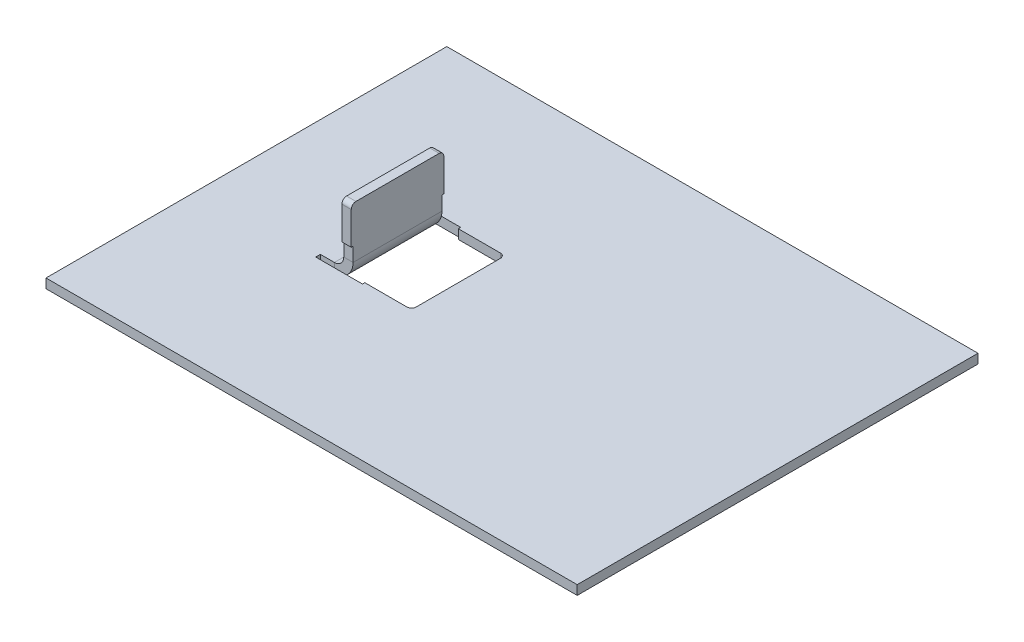
ISO-10303-21;
HEADER;
FILE_DESCRIPTION(('STEP AP214'),'2;1');
FILE_NAME('part.step','',(''),(''),'','','');
FILE_SCHEMA(('AUTOMOTIVE_DESIGN { 1 0 10303 214 1 1 1 1 }'));
ENDSEC;
DATA;
#1=APPLICATION_CONTEXT('core data for automotive mechanical design processes');
#2=APPLICATION_PROTOCOL_DEFINITION('international standard','automotive_design',2000,#1);
#3=PRODUCT_CONTEXT('',#1,'mechanical');
#4=PRODUCT('Part','Part','',(#3));
#5=PRODUCT_RELATED_PRODUCT_CATEGORY('part','',(#4));
#6=PRODUCT_DEFINITION_FORMATION('','',#4);
#7=PRODUCT_DEFINITION_CONTEXT('part definition',#1,'design');
#8=PRODUCT_DEFINITION('design','',#6,#7);
#9=PRODUCT_DEFINITION_SHAPE('','',#8);
#10=(LENGTH_UNIT() NAMED_UNIT(*) SI_UNIT(.MILLI.,.METRE.));
#11=(NAMED_UNIT(*) PLANE_ANGLE_UNIT() SI_UNIT($,.RADIAN.));
#12=(NAMED_UNIT(*) SI_UNIT($,.STERADIAN.) SOLID_ANGLE_UNIT());
#13=UNCERTAINTY_MEASURE_WITH_UNIT(LENGTH_MEASURE(1.E-05),#10,'distance_accuracy_value','');
#14=(GEOMETRIC_REPRESENTATION_CONTEXT(3) GLOBAL_UNCERTAINTY_ASSIGNED_CONTEXT((#13)) GLOBAL_UNIT_ASSIGNED_CONTEXT((#10,
#11,#12)) REPRESENTATION_CONTEXT('',''));
#15=CARTESIAN_POINT('',(0.,0.,0.));
#16=DIRECTION('',(0.,0.,1.));
#17=DIRECTION('',(1.,0.,0.));
#18=AXIS2_PLACEMENT_3D('',#15,#16,#17);
#19=CARTESIAN_POINT('',(29.9664364091211,33.,-33.7227848020921));
#20=DIRECTION('',(0.,0.,-1.));
#21=DIRECTION('',(0.,1.,0.));
#22=AXIS2_PLACEMENT_3D('',#19,#20,#21);
#23=PLANE('',#22);
#24=DIRECTION('',(-1.,0.,0.));
#25=VECTOR('',#24,1.);
#26=CARTESIAN_POINT('',(29.9664364091211,22.,-33.7227848020921));
#27=LINE('',#26,#25);
#28=CARTESIAN_POINT('',(31.9664364091211,22.,-33.7227848020921));
#29=VERTEX_POINT('',#28);
#30=CARTESIAN_POINT('',(29.9664364091211,22.,-33.7227848020921));
#31=VERTEX_POINT('',#30);
#32=EDGE_CURVE('E11',#29,#31,#27,.T.);
#33=ORIENTED_EDGE('',*,*,#32,.F.);
#34=DIRECTION('',(0.,1.,0.));
#35=VECTOR('',#34,1.);
#36=CARTESIAN_POINT('',(31.9664364091211,33.,-33.7227848020921));
#37=LINE('',#36,#35);
#38=CARTESIAN_POINT('',(31.9664364091211,25.,-33.7227848020921));
#39=VERTEX_POINT('',#38);
#40=EDGE_CURVE('E150',#29,#39,#37,.T.);
#41=ORIENTED_EDGE('',*,*,#40,.T.);
#42=DIRECTION('',(-1.,0.,0.));
#43=VECTOR('',#42,1.);
#44=CARTESIAN_POINT('',(29.9664364091211,25.,-33.7227848020921));
#45=LINE('',#44,#43);
#46=CARTESIAN_POINT('',(29.9664364091211,25.,-33.7227848020921));
#47=VERTEX_POINT('',#46);
#48=EDGE_CURVE('E50',#39,#47,#45,.T.);
#49=ORIENTED_EDGE('',*,*,#48,.T.);
#50=DIRECTION('',(0.,1.,0.));
#51=VECTOR('',#50,1.);
#52=CARTESIAN_POINT('',(29.9664364091211,33.,-33.7227848020921));
#53=LINE('',#52,#51);
#54=EDGE_CURVE('E153',#31,#47,#53,.T.);
#55=ORIENTED_EDGE('',*,*,#54,.F.);
#56=EDGE_LOOP('',(#33,#41,#49,#55));
#57=FACE_BOUND('',#56,.T.);
#58=ADVANCED_FACE('F40',(#57),#23,.F.);
#59=CARTESIAN_POINT('',(29.9664364091211,25.,-53.2227848020921));
#60=DIRECTION('',(0.,1.,0.));
#61=DIRECTION('',(0.,0.,1.));
#62=AXIS2_PLACEMENT_3D('',#59,#60,#61);
#63=PLANE('',#62);
#64=ORIENTED_EDGE('',*,*,#48,.F.);
#65=DIRECTION('',(0.,0.,-1.));
#66=VECTOR('',#65,1.);
#67=CARTESIAN_POINT('',(31.9664364091211,25.,-53.2227848020921));
#68=LINE('',#67,#66);
#69=CARTESIAN_POINT('',(31.9664364091211,25.,-33.3227848020921));
#70=VERTEX_POINT('',#69);
#71=EDGE_CURVE('E179',#39,#70,#68,.F.);
#72=ORIENTED_EDGE('',*,*,#71,.T.);
#73=DIRECTION('',(-1.,0.,0.));
#74=VECTOR('',#73,1.);
#75=CARTESIAN_POINT('',(29.9664364091211,25.,-33.3227848020921));
#76=LINE('',#75,#74);
#77=CARTESIAN_POINT('',(29.9664364091211,25.,-33.3227848020921));
#78=VERTEX_POINT('',#77);
#79=EDGE_CURVE('E260',#70,#78,#76,.T.);
#80=ORIENTED_EDGE('',*,*,#79,.T.);
#81=DIRECTION('',(0.,0.,1.));
#82=VECTOR('',#81,1.);
#83=CARTESIAN_POINT('',(29.9664364091211,25.,-53.2227848020921));
#84=LINE('',#83,#82);
#85=EDGE_CURVE('E274',#47,#78,#84,.T.);
#86=ORIENTED_EDGE('',*,*,#85,.F.);
#87=EDGE_LOOP('',(#64,#72,#80,#86));
#88=FACE_BOUND('',#87,.T.);
#89=ADVANCED_FACE('F280',(#88),#63,.F.);
#90=CARTESIAN_POINT('',(29.9664364091211,33.,-33.3227848020921));
#91=DIRECTION('',(0.,0.,1.));
#92=DIRECTION('',(0.,-1.,0.));
#93=AXIS2_PLACEMENT_3D('',#90,#91,#92);
#94=PLANE('',#93);
#95=ORIENTED_EDGE('',*,*,#79,.F.);
#96=DIRECTION('',(0.,1.,0.));
#97=VECTOR('',#96,1.);
#98=CARTESIAN_POINT('',(31.9664364091211,33.,-33.3227848020921));
#99=LINE('',#98,#97);
#100=CARTESIAN_POINT('',(31.9664364091211,32.,-33.3227848020921));
#101=VERTEX_POINT('',#100);
#102=EDGE_CURVE('E362',#101,#70,#99,.F.);
#103=ORIENTED_EDGE('',*,*,#102,.F.);
#104=DIRECTION('',(-1.,0.,0.));
#105=VECTOR('',#104,1.);
#106=CARTESIAN_POINT('',(29.9664364091211,32.,-33.3227848020921));
#107=LINE('',#106,#105);
#108=CARTESIAN_POINT('',(29.9664364091211,32.,-33.3227848020921));
#109=VERTEX_POINT('',#108);
#110=EDGE_CURVE('E257',#101,#109,#107,.T.);
#111=ORIENTED_EDGE('',*,*,#110,.T.);
#112=DIRECTION('',(0.,-1.,0.));
#113=VECTOR('',#112,1.);
#114=CARTESIAN_POINT('',(29.9664364091211,33.,-33.3227848020921));
#115=LINE('',#114,#113);
#116=EDGE_CURVE('E375',#109,#78,#115,.T.);
#117=ORIENTED_EDGE('',*,*,#116,.T.);
#118=EDGE_LOOP('',(#95,#103,#111,#117));
#119=FACE_BOUND('',#118,.T.);
#120=ADVANCED_FACE('F373',(#119),#94,.T.);
#121=CARTESIAN_POINT('',(29.9664364091211,32.,-34.3227848020921));
#122=DIRECTION('',(1.,0.,0.));
#123=DIRECTION('',(0.,0.,-1.));
#124=AXIS2_PLACEMENT_3D('',#121,#122,#123);
#125=CYLINDRICAL_SURFACE('',#124,1.);
#126=ORIENTED_EDGE('',*,*,#110,.F.);
#127=CARTESIAN_POINT('',(31.9664364091211,32.,-34.3227848020921));
#128=DIRECTION('',(1.,0.,0.));
#129=DIRECTION('',(0.,0.,-1.));
#130=AXIS2_PLACEMENT_3D('',#127,#128,#129);
#131=CIRCLE('',#130,1.);
#132=CARTESIAN_POINT('',(31.9664364091211,33.,-34.3227848020921));
#133=VERTEX_POINT('',#132);
#134=EDGE_CURVE('E309',#101,#133,#131,.F.);
#135=ORIENTED_EDGE('',*,*,#134,.T.);
#136=DIRECTION('',(-1.,0.,0.));
#137=VECTOR('',#136,1.);
#138=CARTESIAN_POINT('',(29.9664364091211,33.,-34.3227848020921));
#139=LINE('',#138,#137);
#140=CARTESIAN_POINT('',(29.9664364091211,33.,-34.3227848020921));
#141=VERTEX_POINT('',#140);
#142=EDGE_CURVE('E254',#133,#141,#139,.T.);
#143=ORIENTED_EDGE('',*,*,#142,.T.);
#144=CARTESIAN_POINT('',(29.9664364091211,32.,-34.3227848020921));
#145=DIRECTION('',(1.,0.,0.));
#146=DIRECTION('',(0.,0.,-1.));
#147=AXIS2_PLACEMENT_3D('',#144,#145,#146);
#148=CIRCLE('',#147,1.);
#149=EDGE_CURVE('E380',#109,#141,#148,.F.);
#150=ORIENTED_EDGE('',*,*,#149,.F.);
#151=EDGE_LOOP('',(#126,#135,#143,#150));
#152=FACE_BOUND('',#151,.T.);
#153=ADVANCED_FACE('F569',(#152),#125,.T.);
#154=CARTESIAN_POINT('',(29.9664364091211,33.,-53.2227848020921));
#155=DIRECTION('',(0.,1.,0.));
#156=DIRECTION('',(0.,0.,1.));
#157=AXIS2_PLACEMENT_3D('',#154,#155,#156);
#158=PLANE('',#157);
#159=ORIENTED_EDGE('',*,*,#142,.F.);
#160=DIRECTION('',(0.,0.,-1.));
#161=VECTOR('',#160,1.);
#162=CARTESIAN_POINT('',(31.9664364091211,33.,-53.2227848020921));
#163=LINE('',#162,#161);
#164=CARTESIAN_POINT('',(31.9664364091211,33.,-52.1227848020921));
#165=VERTEX_POINT('',#164);
#166=EDGE_CURVE('E185',#165,#133,#163,.F.);
#167=ORIENTED_EDGE('',*,*,#166,.F.);
#168=DIRECTION('',(-1.,0.,0.));
#169=VECTOR('',#168,1.);
#170=CARTESIAN_POINT('',(29.9664364091211,33.,-52.1227848020921));
#171=LINE('',#170,#169);
#172=CARTESIAN_POINT('',(29.9664364091211,33.,-52.1227848020921));
#173=VERTEX_POINT('',#172);
#174=EDGE_CURVE('E251',#165,#173,#171,.T.);
#175=ORIENTED_EDGE('',*,*,#174,.T.);
#176=DIRECTION('',(0.,0.,1.));
#177=VECTOR('',#176,1.);
#178=CARTESIAN_POINT('',(29.9664364091211,33.,-53.2227848020921));
#179=LINE('',#178,#177);
#180=EDGE_CURVE('E303',#173,#141,#179,.T.);
#181=ORIENTED_EDGE('',*,*,#180,.T.);
#182=EDGE_LOOP('',(#159,#167,#175,#181));
#183=FACE_BOUND('',#182,.T.);
#184=ADVANCED_FACE('F536',(#183),#158,.T.);
#185=CARTESIAN_POINT('',(29.9664364091211,32.,-52.1227848020921));
#186=DIRECTION('',(1.,0.,0.));
#187=DIRECTION('',(0.,0.,-1.));
#188=AXIS2_PLACEMENT_3D('',#185,#186,#187);
#189=CYLINDRICAL_SURFACE('',#188,1.);
#190=ORIENTED_EDGE('',*,*,#174,.F.);
#191=CARTESIAN_POINT('',(31.9664364091211,32.,-52.1227848020921));
#192=DIRECTION('',(1.,0.,0.));
#193=DIRECTION('',(0.,0.,-1.));
#194=AXIS2_PLACEMENT_3D('',#191,#192,#193);
#195=CIRCLE('',#194,1.);
#196=CARTESIAN_POINT('',(31.9664364091211,32.,-53.1227848020921));
#197=VERTEX_POINT('',#196);
#198=EDGE_CURVE('E363',#165,#197,#195,.F.);
#199=ORIENTED_EDGE('',*,*,#198,.T.);
#200=DIRECTION('',(-1.,0.,0.));
#201=VECTOR('',#200,1.);
#202=CARTESIAN_POINT('',(29.9664364091211,32.,-53.1227848020921));
#203=LINE('',#202,#201);
#204=CARTESIAN_POINT('',(29.9664364091211,32.,-53.1227848020921));
#205=VERTEX_POINT('',#204);
#206=EDGE_CURVE('E248',#197,#205,#203,.T.);
#207=ORIENTED_EDGE('',*,*,#206,.T.);
#208=CARTESIAN_POINT('',(29.9664364091211,32.,-52.1227848020921));
#209=DIRECTION('',(1.,0.,0.));
#210=DIRECTION('',(0.,0.,-1.));
#211=AXIS2_PLACEMENT_3D('',#208,#209,#210);
#212=CIRCLE('',#211,1.);
#213=EDGE_CURVE('E386',#173,#205,#212,.F.);
#214=ORIENTED_EDGE('',*,*,#213,.F.);
#215=EDGE_LOOP('',(#190,#199,#207,#214));
#216=FACE_BOUND('',#215,.T.);
#217=ADVANCED_FACE('F543',(#216),#189,.T.);
#218=CARTESIAN_POINT('',(29.9664364091211,33.,-53.1227848020921));
#219=DIRECTION('',(0.,0.,1.));
#220=DIRECTION('',(0.,-1.,0.));
#221=AXIS2_PLACEMENT_3D('',#218,#219,#220);
#222=PLANE('',#221);
#223=ORIENTED_EDGE('',*,*,#206,.F.);
#224=DIRECTION('',(0.,1.,0.));
#225=VECTOR('',#224,1.);
#226=CARTESIAN_POINT('',(31.9664364091211,33.,-53.1227848020921));
#227=LINE('',#226,#225);
#228=CARTESIAN_POINT('',(31.9664364091211,25.,-53.1227848020921));
#229=VERTEX_POINT('',#228);
#230=EDGE_CURVE('E359',#197,#229,#227,.F.);
#231=ORIENTED_EDGE('',*,*,#230,.T.);
#232=DIRECTION('',(-1.,0.,0.));
#233=VECTOR('',#232,1.);
#234=CARTESIAN_POINT('',(29.9664364091211,25.,-53.1227848020921));
#235=LINE('',#234,#233);
#236=CARTESIAN_POINT('',(29.9664364091211,25.,-53.1227848020921));
#237=VERTEX_POINT('',#236);
#238=EDGE_CURVE('E245',#229,#237,#235,.T.);
#239=ORIENTED_EDGE('',*,*,#238,.T.);
#240=DIRECTION('',(0.,-1.,0.));
#241=VECTOR('',#240,1.);
#242=CARTESIAN_POINT('',(29.9664364091211,33.,-53.1227848020921));
#243=LINE('',#242,#241);
#244=EDGE_CURVE('E381',#205,#237,#243,.T.);
#245=ORIENTED_EDGE('',*,*,#244,.F.);
#246=EDGE_LOOP('',(#223,#231,#239,#245));
#247=FACE_BOUND('',#246,.T.);
#248=ADVANCED_FACE('F546',(#247),#222,.F.);
#249=CARTESIAN_POINT('',(29.9664364091211,25.,-53.2227848020921));
#250=DIRECTION('',(0.,1.,0.));
#251=DIRECTION('',(0.,0.,1.));
#252=AXIS2_PLACEMENT_3D('',#249,#250,#251);
#253=PLANE('',#252);
#254=ORIENTED_EDGE('',*,*,#238,.F.);
#255=DIRECTION('',(0.,0.,-1.));
#256=VECTOR('',#255,1.);
#257=CARTESIAN_POINT('',(31.9664364091211,25.,-53.2227848020921));
#258=LINE('',#257,#256);
#259=CARTESIAN_POINT('',(31.9664364091211,25.,-52.7227848020921));
#260=VERTEX_POINT('',#259);
#261=EDGE_CURVE('E332',#229,#260,#258,.F.);
#262=ORIENTED_EDGE('',*,*,#261,.T.);
#263=DIRECTION('',(-1.,0.,0.));
#264=VECTOR('',#263,1.);
#265=CARTESIAN_POINT('',(29.9664364091211,25.,-52.7227848020921));
#266=LINE('',#265,#264);
#267=CARTESIAN_POINT('',(29.9664364091211,25.,-52.7227848020921));
#268=VERTEX_POINT('',#267);
#269=EDGE_CURVE('E242',#260,#268,#266,.T.);
#270=ORIENTED_EDGE('',*,*,#269,.T.);
#271=DIRECTION('',(0.,0.,1.));
#272=VECTOR('',#271,1.);
#273=CARTESIAN_POINT('',(29.9664364091211,25.,-53.2227848020921));
#274=LINE('',#273,#272);
#275=EDGE_CURVE('E416',#237,#268,#274,.T.);
#276=ORIENTED_EDGE('',*,*,#275,.F.);
#277=EDGE_LOOP('',(#254,#262,#270,#276));
#278=FACE_BOUND('',#277,.T.);
#279=ADVANCED_FACE('F549',(#278),#253,.F.);
#280=CARTESIAN_POINT('',(29.9664364091211,33.,-52.7227848020921));
#281=DIRECTION('',(0.,0.,1.));
#282=DIRECTION('',(0.,-1.,0.));
#283=AXIS2_PLACEMENT_3D('',#280,#281,#282);
#284=PLANE('',#283);
#285=ORIENTED_EDGE('',*,*,#269,.F.);
#286=DIRECTION('',(0.,1.,0.));
#287=VECTOR('',#286,1.);
#288=CARTESIAN_POINT('',(31.9664364091211,33.,-52.7227848020921));
#289=LINE('',#288,#287);
#290=CARTESIAN_POINT('',(31.9664364091211,22.,-52.7227848020921));
#291=VERTEX_POINT('',#290);
#292=EDGE_CURVE('E348',#260,#291,#289,.F.);
#293=ORIENTED_EDGE('',*,*,#292,.T.);
#294=DIRECTION('',(-1.,0.,0.));
#295=VECTOR('',#294,1.);
#296=CARTESIAN_POINT('',(29.9664364091211,22.,-52.7227848020921));
#297=LINE('',#296,#295);
#298=CARTESIAN_POINT('',(29.9664364091211,22.,-52.7227848020921));
#299=VERTEX_POINT('',#298);
#300=EDGE_CURVE('E239',#291,#299,#297,.T.);
#301=ORIENTED_EDGE('',*,*,#300,.T.);
#302=DIRECTION('',(0.,-1.,0.));
#303=VECTOR('',#302,1.);
#304=CARTESIAN_POINT('',(29.9664364091211,33.,-52.7227848020921));
#305=LINE('',#304,#303);
#306=EDGE_CURVE('E419',#268,#299,#305,.T.);
#307=ORIENTED_EDGE('',*,*,#306,.F.);
#308=EDGE_LOOP('',(#285,#293,#301,#307));
#309=FACE_BOUND('',#308,.T.);
#310=ADVANCED_FACE('F551',(#309),#284,.F.);
#311=CARTESIAN_POINT('',(27.9664364091211,22.,-52.7227848020921));
#312=DIRECTION('',(0.,0.,-1.));
#313=DIRECTION('',(-1.,0.,0.));
#314=AXIS2_PLACEMENT_3D('',#311,#312,#313);
#315=PLANE('',#314);
#316=ORIENTED_EDGE('',*,*,#300,.F.);
#317=CARTESIAN_POINT('',(27.9664364091211,22.,-52.7227848020921));
#318=DIRECTION('',(0.,0.,-1.));
#319=DIRECTION('',(-1.,0.,0.));
#320=AXIS2_PLACEMENT_3D('',#317,#318,#319);
#321=CIRCLE('',#320,4.);
#322=CARTESIAN_POINT('',(27.9664364091211,18.,-52.7227848020921));
#323=VERTEX_POINT('',#322);
#324=EDGE_CURVE('E168',#291,#323,#321,.T.);
#325=ORIENTED_EDGE('',*,*,#324,.T.);
#326=DIRECTION('',(0.,1.,0.));
#327=VECTOR('',#326,1.);
#328=CARTESIAN_POINT('',(27.9664364091211,20.,-52.7227848020921));
#329=LINE('',#328,#327);
#330=CARTESIAN_POINT('',(27.9664364091211,20.,-52.7227848020921));
#331=VERTEX_POINT('',#330);
#332=EDGE_CURVE('E58',#323,#331,#329,.T.);
#333=ORIENTED_EDGE('',*,*,#332,.T.);
#334=CARTESIAN_POINT('',(27.9664364091211,22.,-52.7227848020921));
#335=DIRECTION('',(0.,0.,1.));
#336=DIRECTION('',(1.,0.,0.));
#337=AXIS2_PLACEMENT_3D('',#334,#335,#336);
#338=CIRCLE('',#337,2.);
#339=EDGE_CURVE('E301',#299,#331,#338,.F.);
#340=ORIENTED_EDGE('',*,*,#339,.F.);
#341=EDGE_LOOP('',(#316,#325,#333,#340));
#342=FACE_BOUND('',#341,.T.);
#343=ADVANCED_FACE('F513',(#342),#315,.T.);
#344=CARTESIAN_POINT('',(0.,20.,-52.7227848020921));
#345=DIRECTION('',(0.,0.,1.));
#346=DIRECTION('',(-1.,0.,0.));
#347=AXIS2_PLACEMENT_3D('',#344,#345,#346);
#348=PLANE('',#347);
#349=ORIENTED_EDGE('',*,*,#332,.F.);
#350=DIRECTION('',(1.,0.,0.));
#351=VECTOR('',#350,1.);
#352=CARTESIAN_POINT('',(0.,18.,-52.7227848020921));
#353=LINE('',#352,#351);
#354=CARTESIAN_POINT('',(24.9664364091211,18.,-52.7227848020921));
#355=VERTEX_POINT('',#354);
#356=EDGE_CURVE('E180',#323,#355,#353,.F.);
#357=ORIENTED_EDGE('',*,*,#356,.T.);
#358=DIRECTION('',(0.,1.,0.));
#359=VECTOR('',#358,1.);
#360=CARTESIAN_POINT('',(24.9664364091211,20.,-52.7227848020921));
#361=LINE('',#360,#359);
#362=CARTESIAN_POINT('',(24.9664364091211,20.,-52.7227848020921));
#363=VERTEX_POINT('',#362);
#364=EDGE_CURVE('E235',#355,#363,#361,.T.);
#365=ORIENTED_EDGE('',*,*,#364,.T.);
#366=DIRECTION('',(-1.,0.,0.));
#367=VECTOR('',#366,1.);
#368=CARTESIAN_POINT('',(0.,20.,-52.7227848020921));
#369=LINE('',#368,#367);
#370=EDGE_CURVE('E278',#331,#363,#369,.T.);
#371=ORIENTED_EDGE('',*,*,#370,.F.);
#372=EDGE_LOOP('',(#349,#357,#365,#371));
#373=FACE_BOUND('',#372,.T.);
#374=ADVANCED_FACE('F558',(#373),#348,.F.);
#375=CARTESIAN_POINT('',(24.9664364091212,20.,0.));
#376=DIRECTION('',(-1.,0.,0.));
#377=DIRECTION('',(0.,0.,-1.));
#378=AXIS2_PLACEMENT_3D('',#375,#376,#377);
#379=PLANE('',#378);
#380=ORIENTED_EDGE('',*,*,#364,.F.);
#381=DIRECTION('',(0.,0.,-1.));
#382=VECTOR('',#381,1.);
#383=CARTESIAN_POINT('',(24.9664364091211,18.,0.));
#384=LINE('',#383,#382);
#385=CARTESIAN_POINT('',(24.9664364091211,18.,-53.7227848020921));
#386=VERTEX_POINT('',#385);
#387=EDGE_CURVE('E351',#355,#386,#384,.T.);
#388=ORIENTED_EDGE('',*,*,#387,.T.);
#389=DIRECTION('',(0.,1.,0.));
#390=VECTOR('',#389,1.);
#391=CARTESIAN_POINT('',(24.9664364091211,20.,-53.7227848020921));
#392=LINE('',#391,#390);
#393=CARTESIAN_POINT('',(24.9664364091211,20.,-53.7227848020921));
#394=VERTEX_POINT('',#393);
#395=EDGE_CURVE('E232',#386,#394,#392,.T.);
#396=ORIENTED_EDGE('',*,*,#395,.T.);
#397=DIRECTION('',(0.,0.,-1.));
#398=VECTOR('',#397,1.);
#399=CARTESIAN_POINT('',(24.9664364091212,20.,0.));
#400=LINE('',#399,#398);
#401=EDGE_CURVE('E427',#363,#394,#400,.T.);
#402=ORIENTED_EDGE('',*,*,#401,.F.);
#403=EDGE_LOOP('',(#380,#388,#396,#402));
#404=FACE_BOUND('',#403,.T.);
#405=ADVANCED_FACE('F440',(#404),#379,.F.);
#406=CARTESIAN_POINT('',(0.,20.,-53.7227848020921));
#407=DIRECTION('',(0.,0.,-1.));
#408=DIRECTION('',(1.,0.,0.));
#409=AXIS2_PLACEMENT_3D('',#406,#407,#408);
#410=PLANE('',#409);
#411=ORIENTED_EDGE('',*,*,#395,.F.);
#412=DIRECTION('',(1.,0.,0.));
#413=VECTOR('',#412,1.);
#414=CARTESIAN_POINT('',(0.,18.,-53.7227848020921));
#415=LINE('',#414,#413);
#416=CARTESIAN_POINT('',(34.9664364091211,18.,-53.7227848020921));
#417=VERTEX_POINT('',#416);
#418=EDGE_CURVE('E347',#386,#417,#415,.T.);
#419=ORIENTED_EDGE('',*,*,#418,.T.);
#420=DIRECTION('',(0.,1.,0.));
#421=VECTOR('',#420,1.);
#422=CARTESIAN_POINT('',(34.9664364091211,20.,-53.7227848020921));
#423=LINE('',#422,#421);
#424=CARTESIAN_POINT('',(34.9664364091211,20.,-53.7227848020921));
#425=VERTEX_POINT('',#424);
#426=EDGE_CURVE('E229',#417,#425,#423,.T.);
#427=ORIENTED_EDGE('',*,*,#426,.T.);
#428=DIRECTION('',(1.,0.,0.));
#429=VECTOR('',#428,1.);
#430=CARTESIAN_POINT('',(0.,20.,-53.7227848020921));
#431=LINE('',#430,#429);
#432=EDGE_CURVE('E424',#394,#425,#431,.T.);
#433=ORIENTED_EDGE('',*,*,#432,.F.);
#434=EDGE_LOOP('',(#411,#419,#427,#433));
#435=FACE_BOUND('',#434,.T.);
#436=ADVANCED_FACE('F446',(#435),#410,.F.);
#437=CARTESIAN_POINT('',(34.9664364091211,20.,0.));
#438=DIRECTION('',(-1.,0.,0.));
#439=DIRECTION('',(0.,0.,-1.));
#440=AXIS2_PLACEMENT_3D('',#437,#438,#439);
#441=PLANE('',#440);
#442=ORIENTED_EDGE('',*,*,#426,.F.);
#443=DIRECTION('',(0.,0.,-1.));
#444=VECTOR('',#443,1.);
#445=CARTESIAN_POINT('',(34.9664364091211,18.,0.));
#446=LINE('',#445,#444);
#447=CARTESIAN_POINT('',(34.9664364091211,18.,-53.2227848020921));
#448=VERTEX_POINT('',#447);
#449=EDGE_CURVE('E344',#448,#417,#446,.T.);
#450=ORIENTED_EDGE('',*,*,#449,.F.);
#451=DIRECTION('',(0.,1.,0.));
#452=VECTOR('',#451,1.);
#453=CARTESIAN_POINT('',(34.9664364091211,20.,-53.2227848020921));
#454=LINE('',#453,#452);
#455=CARTESIAN_POINT('',(34.9664364091211,20.,-53.2227848020921));
#456=VERTEX_POINT('',#455);
#457=EDGE_CURVE('E226',#448,#456,#454,.T.);
#458=ORIENTED_EDGE('',*,*,#457,.T.);
#459=DIRECTION('',(0.,0.,-1.));
#460=VECTOR('',#459,1.);
#461=CARTESIAN_POINT('',(34.9664364091211,20.,0.));
#462=LINE('',#461,#460);
#463=EDGE_CURVE('E421',#456,#425,#462,.T.);
#464=ORIENTED_EDGE('',*,*,#463,.T.);
#465=EDGE_LOOP('',(#442,#450,#458,#464));
#466=FACE_BOUND('',#465,.T.);
#467=ADVANCED_FACE('F455',(#466),#441,.T.);
#468=CARTESIAN_POINT('',(29.9664364091211,20.,-53.2227848020921));
#469=DIRECTION('',(0.,0.,1.));
#470=DIRECTION('',(-1.,0.,0.));
#471=AXIS2_PLACEMENT_3D('',#468,#469,#470);
#472=PLANE('',#471);
#473=ORIENTED_EDGE('',*,*,#457,.F.);
#474=DIRECTION('',(1.,0.,0.));
#475=VECTOR('',#474,1.);
#476=CARTESIAN_POINT('',(0.,18.,-53.2227848020921));
#477=LINE('',#476,#475);
#478=CARTESIAN_POINT('',(43.9664364091211,18.,-53.2227848020921));
#479=VERTEX_POINT('',#478);
#480=EDGE_CURVE('E313',#479,#448,#477,.F.);
#481=ORIENTED_EDGE('',*,*,#480,.F.);
#482=DIRECTION('',(0.,1.,0.));
#483=VECTOR('',#482,1.);
#484=CARTESIAN_POINT('',(43.9664364091211,20.,-53.2227848020921));
#485=LINE('',#484,#483);
#486=CARTESIAN_POINT('',(43.9664364091211,20.,-53.2227848020921));
#487=VERTEX_POINT('',#486);
#488=EDGE_CURVE('E223',#479,#487,#485,.T.);
#489=ORIENTED_EDGE('',*,*,#488,.T.);
#490=DIRECTION('',(-1.,0.,0.));
#491=VECTOR('',#490,1.);
#492=CARTESIAN_POINT('',(29.9664364091211,20.,-53.2227848020921));
#493=LINE('',#492,#491);
#494=EDGE_CURVE('E401',#487,#456,#493,.T.);
#495=ORIENTED_EDGE('',*,*,#494,.T.);
#496=EDGE_LOOP('',(#473,#481,#489,#495));
#497=FACE_BOUND('',#496,.T.);
#498=ADVANCED_FACE('F465',(#497),#472,.T.);
#499=CARTESIAN_POINT('',(43.9664364091211,20.,-52.2227848020921));
#500=DIRECTION('',(0.,-1.,0.));
#501=DIRECTION('',(0.,0.,-1.));
#502=AXIS2_PLACEMENT_3D('',#499,#500,#501);
#503=CYLINDRICAL_SURFACE('',#502,1.);
#504=ORIENTED_EDGE('',*,*,#488,.F.);
#505=CARTESIAN_POINT('',(43.9664364091211,18.,-52.2227848020921));
#506=DIRECTION('',(0.,-1.,0.));
#507=DIRECTION('',(0.,0.,-1.));
#508=AXIS2_PLACEMENT_3D('',#505,#506,#507);
#509=CIRCLE('',#508,1.);
#510=CARTESIAN_POINT('',(44.9664364091211,18.,-52.2227848020921));
#511=VERTEX_POINT('',#510);
#512=EDGE_CURVE('E339',#479,#511,#509,.T.);
#513=ORIENTED_EDGE('',*,*,#512,.T.);
#514=DIRECTION('',(0.,1.,0.));
#515=VECTOR('',#514,1.);
#516=CARTESIAN_POINT('',(44.9664364091211,20.,-52.2227848020921));
#517=LINE('',#516,#515);
#518=CARTESIAN_POINT('',(44.9664364091211,20.,-52.2227848020921));
#519=VERTEX_POINT('',#518);
#520=EDGE_CURVE('E220',#511,#519,#517,.T.);
#521=ORIENTED_EDGE('',*,*,#520,.T.);
#522=CARTESIAN_POINT('',(43.9664364091211,20.,-52.2227848020921));
#523=DIRECTION('',(0.,-1.,0.));
#524=DIRECTION('',(0.,0.,-1.));
#525=AXIS2_PLACEMENT_3D('',#522,#523,#524);
#526=CIRCLE('',#525,1.);
#527=EDGE_CURVE('E404',#487,#519,#526,.T.);
#528=ORIENTED_EDGE('',*,*,#527,.F.);
#529=EDGE_LOOP('',(#504,#513,#521,#528));
#530=FACE_BOUND('',#529,.T.);
#531=ADVANCED_FACE('F470',(#530),#503,.F.);
#532=CARTESIAN_POINT('',(44.9664364091211,20.,-53.2227848020921));
#533=DIRECTION('',(-1.,0.,0.));
#534=DIRECTION('',(0.,0.,-1.));
#535=AXIS2_PLACEMENT_3D('',#532,#533,#534);
#536=PLANE('',#535);
#537=ORIENTED_EDGE('',*,*,#520,.F.);
#538=DIRECTION('',(0.,0.,-1.));
#539=VECTOR('',#538,1.);
#540=CARTESIAN_POINT('',(44.9664364091211,18.,0.));
#541=LINE('',#540,#539);
#542=CARTESIAN_POINT('',(44.9664364091211,18.,-34.2227848020921));
#543=VERTEX_POINT('',#542);
#544=EDGE_CURVE('E336',#543,#511,#541,.T.);
#545=ORIENTED_EDGE('',*,*,#544,.F.);
#546=DIRECTION('',(0.,1.,0.));
#547=VECTOR('',#546,1.);
#548=CARTESIAN_POINT('',(44.9664364091211,20.,-34.2227848020921));
#549=LINE('',#548,#547);
#550=CARTESIAN_POINT('',(44.9664364091211,20.,-34.2227848020921));
#551=VERTEX_POINT('',#550);
#552=EDGE_CURVE('E217',#543,#551,#549,.T.);
#553=ORIENTED_EDGE('',*,*,#552,.T.);
#554=DIRECTION('',(0.,0.,-1.));
#555=VECTOR('',#554,1.);
#556=CARTESIAN_POINT('',(44.9664364091211,20.,-53.2227848020921));
#557=LINE('',#556,#555);
#558=EDGE_CURVE('E407',#551,#519,#557,.T.);
#559=ORIENTED_EDGE('',*,*,#558,.T.);
#560=EDGE_LOOP('',(#537,#545,#553,#559));
#561=FACE_BOUND('',#560,.T.);
#562=ADVANCED_FACE('F474',(#561),#536,.T.);
#563=CARTESIAN_POINT('',(43.9664364091211,20.,-34.2227848020921));
#564=DIRECTION('',(0.,-1.,0.));
#565=DIRECTION('',(0.,0.,-1.));
#566=AXIS2_PLACEMENT_3D('',#563,#564,#565);
#567=CYLINDRICAL_SURFACE('',#566,1.);
#568=ORIENTED_EDGE('',*,*,#552,.F.);
#569=CARTESIAN_POINT('',(43.9664364091211,18.,-34.2227848020921));
#570=DIRECTION('',(0.,-1.,0.));
#571=DIRECTION('',(0.,0.,-1.));
#572=AXIS2_PLACEMENT_3D('',#569,#570,#571);
#573=CIRCLE('',#572,1.);
#574=CARTESIAN_POINT('',(43.9664364091211,18.,-33.2227848020921));
#575=VERTEX_POINT('',#574);
#576=EDGE_CURVE('E333',#543,#575,#573,.T.);
#577=ORIENTED_EDGE('',*,*,#576,.T.);
#578=DIRECTION('',(0.,1.,0.));
#579=VECTOR('',#578,1.);
#580=CARTESIAN_POINT('',(43.9664364091211,20.,-33.2227848020921));
#581=LINE('',#580,#579);
#582=CARTESIAN_POINT('',(43.9664364091211,20.,-33.2227848020921));
#583=VERTEX_POINT('',#582);
#584=EDGE_CURVE('E214',#575,#583,#581,.T.);
#585=ORIENTED_EDGE('',*,*,#584,.T.);
#586=CARTESIAN_POINT('',(43.9664364091211,20.,-34.2227848020921));
#587=DIRECTION('',(0.,-1.,0.));
#588=DIRECTION('',(0.,0.,-1.));
#589=AXIS2_PLACEMENT_3D('',#586,#587,#588);
#590=CIRCLE('',#589,1.);
#591=EDGE_CURVE('E410',#551,#583,#590,.T.);
#592=ORIENTED_EDGE('',*,*,#591,.F.);
#593=EDGE_LOOP('',(#568,#577,#585,#592));
#594=FACE_BOUND('',#593,.T.);
#595=ADVANCED_FACE('F483',(#594),#567,.F.);
#596=CARTESIAN_POINT('',(29.9664364091211,20.,-33.2227848020921));
#597=DIRECTION('',(0.,0.,-1.));
#598=DIRECTION('',(1.,0.,0.));
#599=AXIS2_PLACEMENT_3D('',#596,#597,#598);
#600=PLANE('',#599);
#601=ORIENTED_EDGE('',*,*,#584,.F.);
#602=DIRECTION('',(1.,0.,0.));
#603=VECTOR('',#602,1.);
#604=CARTESIAN_POINT('',(0.,18.,-33.2227848020921));
#605=LINE('',#604,#603);
#606=CARTESIAN_POINT('',(34.9664364091211,18.,-33.2227848020921));
#607=VERTEX_POINT('',#606);
#608=EDGE_CURVE('E329',#607,#575,#605,.T.);
#609=ORIENTED_EDGE('',*,*,#608,.F.);
#610=DIRECTION('',(0.,1.,0.));
#611=VECTOR('',#610,1.);
#612=CARTESIAN_POINT('',(34.9664364091211,20.,-33.2227848020921));
#613=LINE('',#612,#611);
#614=CARTESIAN_POINT('',(34.9664364091211,20.,-33.2227848020921));
#615=VERTEX_POINT('',#614);
#616=EDGE_CURVE('E211',#607,#615,#613,.T.);
#617=ORIENTED_EDGE('',*,*,#616,.T.);
#618=DIRECTION('',(1.,0.,0.));
#619=VECTOR('',#618,1.);
#620=CARTESIAN_POINT('',(29.9664364091211,20.,-33.2227848020921));
#621=LINE('',#620,#619);
#622=EDGE_CURVE('E413',#615,#583,#621,.T.);
#623=ORIENTED_EDGE('',*,*,#622,.T.);
#624=EDGE_LOOP('',(#601,#609,#617,#623));
#625=FACE_BOUND('',#624,.T.);
#626=ADVANCED_FACE('F488',(#625),#600,.T.);
#627=CARTESIAN_POINT('',(34.9664364091211,20.,0.));
#628=DIRECTION('',(-1.,0.,0.));
#629=DIRECTION('',(0.,0.,-1.));
#630=AXIS2_PLACEMENT_3D('',#627,#628,#629);
#631=PLANE('',#630);
#632=ORIENTED_EDGE('',*,*,#616,.F.);
#633=DIRECTION('',(0.,0.,-1.));
#634=VECTOR('',#633,1.);
#635=CARTESIAN_POINT('',(34.9664364091211,18.,0.));
#636=LINE('',#635,#634);
#637=CARTESIAN_POINT('',(34.9664364091211,18.,-32.7227848020921));
#638=VERTEX_POINT('',#637);
#639=EDGE_CURVE('E326',#638,#607,#636,.T.);
#640=ORIENTED_EDGE('',*,*,#639,.F.);
#641=DIRECTION('',(0.,1.,0.));
#642=VECTOR('',#641,1.);
#643=CARTESIAN_POINT('',(34.9664364091211,20.,-32.7227848020921));
#644=LINE('',#643,#642);
#645=CARTESIAN_POINT('',(34.9664364091211,20.,-32.7227848020921));
#646=VERTEX_POINT('',#645);
#647=EDGE_CURVE('E208',#638,#646,#644,.T.);
#648=ORIENTED_EDGE('',*,*,#647,.T.);
#649=DIRECTION('',(0.,0.,-1.));
#650=VECTOR('',#649,1.);
#651=CARTESIAN_POINT('',(34.9664364091211,20.,0.));
#652=LINE('',#651,#650);
#653=EDGE_CURVE('E281',#646,#615,#652,.T.);
#654=ORIENTED_EDGE('',*,*,#653,.T.);
#655=EDGE_LOOP('',(#632,#640,#648,#654));
#656=FACE_BOUND('',#655,.T.);
#657=ADVANCED_FACE('F493',(#656),#631,.T.);
#658=CARTESIAN_POINT('',(0.,20.,-32.7227848020921));
#659=DIRECTION('',(0.,0.,1.));
#660=DIRECTION('',(-1.,0.,0.));
#661=AXIS2_PLACEMENT_3D('',#658,#659,#660);
#662=PLANE('',#661);
#663=ORIENTED_EDGE('',*,*,#647,.F.);
#664=DIRECTION('',(1.,0.,0.));
#665=VECTOR('',#664,1.);
#666=CARTESIAN_POINT('',(0.,18.,-32.7227848020921));
#667=LINE('',#666,#665);
#668=CARTESIAN_POINT('',(24.9664364091211,18.,-32.7227848020921));
#669=VERTEX_POINT('',#668);
#670=EDGE_CURVE('E323',#638,#669,#667,.F.);
#671=ORIENTED_EDGE('',*,*,#670,.T.);
#672=DIRECTION('',(0.,1.,0.));
#673=VECTOR('',#672,1.);
#674=CARTESIAN_POINT('',(24.9664364091211,20.,-32.7227848020921));
#675=LINE('',#674,#673);
#676=CARTESIAN_POINT('',(24.9664364091211,20.,-32.7227848020921));
#677=VERTEX_POINT('',#676);
#678=EDGE_CURVE('E205',#669,#677,#675,.T.);
#679=ORIENTED_EDGE('',*,*,#678,.T.);
#680=DIRECTION('',(-1.,0.,0.));
#681=VECTOR('',#680,1.);
#682=CARTESIAN_POINT('',(0.,20.,-32.7227848020921));
#683=LINE('',#682,#681);
#684=EDGE_CURVE('E284',#646,#677,#683,.T.);
#685=ORIENTED_EDGE('',*,*,#684,.F.);
#686=EDGE_LOOP('',(#663,#671,#679,#685));
#687=FACE_BOUND('',#686,.T.);
#688=ADVANCED_FACE('F502',(#687),#662,.F.);
#689=CARTESIAN_POINT('',(24.9664364091212,20.,0.));
#690=DIRECTION('',(-1.,0.,0.));
#691=DIRECTION('',(0.,0.,-1.));
#692=AXIS2_PLACEMENT_3D('',#689,#690,#691);
#693=PLANE('',#692);
#694=ORIENTED_EDGE('',*,*,#678,.F.);
#695=DIRECTION('',(0.,0.,-1.));
#696=VECTOR('',#695,1.);
#697=CARTESIAN_POINT('',(24.9664364091211,18.,0.));
#698=LINE('',#697,#696);
#699=CARTESIAN_POINT('',(24.9664364091211,18.,-33.7227848020921));
#700=VERTEX_POINT('',#699);
#701=EDGE_CURVE('E320',#669,#700,#698,.T.);
#702=ORIENTED_EDGE('',*,*,#701,.T.);
#703=DIRECTION('',(0.,1.,0.));
#704=VECTOR('',#703,1.);
#705=CARTESIAN_POINT('',(24.9664364091211,20.,-33.7227848020921));
#706=LINE('',#705,#704);
#707=CARTESIAN_POINT('',(24.9664364091211,20.,-33.7227848020921));
#708=VERTEX_POINT('',#707);
#709=EDGE_CURVE('E202',#700,#708,#706,.T.);
#710=ORIENTED_EDGE('',*,*,#709,.T.);
#711=DIRECTION('',(0.,0.,-1.));
#712=VECTOR('',#711,1.);
#713=CARTESIAN_POINT('',(24.9664364091212,20.,0.));
#714=LINE('',#713,#712);
#715=EDGE_CURVE('E290',#677,#708,#714,.T.);
#716=ORIENTED_EDGE('',*,*,#715,.F.);
#717=EDGE_LOOP('',(#694,#702,#710,#716));
#718=FACE_BOUND('',#717,.T.);
#719=ADVANCED_FACE('F506',(#718),#693,.F.);
#720=CARTESIAN_POINT('',(0.,20.,-33.7227848020921));
#721=DIRECTION('',(0.,0.,-1.));
#722=DIRECTION('',(1.,0.,0.));
#723=AXIS2_PLACEMENT_3D('',#720,#721,#722);
#724=PLANE('',#723);
#725=ORIENTED_EDGE('',*,*,#709,.F.);
#726=DIRECTION('',(1.,0.,0.));
#727=VECTOR('',#726,1.);
#728=CARTESIAN_POINT('',(0.,18.,-33.7227848020921));
#729=LINE('',#728,#727);
#730=CARTESIAN_POINT('',(27.9664364091211,18.,-33.7227848020921));
#731=VERTEX_POINT('',#730);
#732=EDGE_CURVE('E173',#700,#731,#729,.T.);
#733=ORIENTED_EDGE('',*,*,#732,.T.);
#734=DIRECTION('',(0.,1.,0.));
#735=VECTOR('',#734,1.);
#736=CARTESIAN_POINT('',(27.9664364091211,20.,-33.7227848020921));
#737=LINE('',#736,#735);
#738=CARTESIAN_POINT('',(27.9664364091211,20.,-33.7227848020921));
#739=VERTEX_POINT('',#738);
#740=EDGE_CURVE('E44',#731,#739,#737,.T.);
#741=ORIENTED_EDGE('',*,*,#740,.T.);
#742=DIRECTION('',(1.,0.,0.));
#743=VECTOR('',#742,1.);
#744=CARTESIAN_POINT('',(0.,20.,-33.7227848020921));
#745=LINE('',#744,#743);
#746=EDGE_CURVE('E293',#708,#739,#745,.T.);
#747=ORIENTED_EDGE('',*,*,#746,.F.);
#748=EDGE_LOOP('',(#725,#733,#741,#747));
#749=FACE_BOUND('',#748,.T.);
#750=ADVANCED_FACE('F508',(#749),#724,.F.);
#751=CARTESIAN_POINT('',(113.617310454242,20.,0.));
#752=DIRECTION('',(-1.,0.,0.));
#753=DIRECTION('',(0.,0.,-1.));
#754=AXIS2_PLACEMENT_3D('',#751,#752,#753);
#755=PLANE('',#754);
#756=DIRECTION('',(0.,1.,0.));
#757=VECTOR('',#756,1.);
#758=CARTESIAN_POINT('',(113.617310454242,20.,0.));
#759=LINE('',#758,#757);
#760=CARTESIAN_POINT('',(113.617310454242,18.,0.));
#761=VERTEX_POINT('',#760);
#762=CARTESIAN_POINT('',(113.617310454242,20.,0.));
#763=VERTEX_POINT('',#762);
#764=EDGE_CURVE('E196',#761,#763,#759,.T.);
#765=ORIENTED_EDGE('',*,*,#764,.F.);
#766=DIRECTION('',(0.,0.,-1.));
#767=VECTOR('',#766,1.);
#768=CARTESIAN_POINT('',(113.617310454242,18.,0.));
#769=LINE('',#768,#767);
#770=CARTESIAN_POINT('',(113.617310454242,18.,-85.7320062563844));
#771=VERTEX_POINT('',#770);
#772=EDGE_CURVE('E314',#761,#771,#769,.T.);
#773=ORIENTED_EDGE('',*,*,#772,.T.);
#774=DIRECTION('',(0.,1.,0.));
#775=VECTOR('',#774,1.);
#776=CARTESIAN_POINT('',(113.617310454242,20.,-85.7320062563844));
#777=LINE('',#776,#775);
#778=CARTESIAN_POINT('',(113.617310454242,20.,-85.7320062563844));
#779=VERTEX_POINT('',#778);
#780=EDGE_CURVE('E192',#771,#779,#777,.T.);
#781=ORIENTED_EDGE('',*,*,#780,.T.);
#782=DIRECTION('',(0.,0.,-1.));
#783=VECTOR('',#782,1.);
#784=CARTESIAN_POINT('',(113.617310454242,20.,0.));
#785=LINE('',#784,#783);
#786=EDGE_CURVE('E395',#763,#779,#785,.T.);
#787=ORIENTED_EDGE('',*,*,#786,.F.);
#788=EDGE_LOOP('',(#765,#773,#781,#787));
#789=FACE_BOUND('',#788,.T.);
#790=ADVANCED_FACE('F716',(#789),#755,.F.);
#791=CARTESIAN_POINT('',(0.,20.,-85.7320062563844));
#792=DIRECTION('',(0.,0.,1.));
#793=DIRECTION('',(-1.,0.,0.));
#794=AXIS2_PLACEMENT_3D('',#791,#792,#793);
#795=PLANE('',#794);
#796=ORIENTED_EDGE('',*,*,#780,.F.);
#797=DIRECTION('',(1.,0.,0.));
#798=VECTOR('',#797,1.);
#799=CARTESIAN_POINT('',(0.,18.,-85.7320062563844));
#800=LINE('',#799,#798);
#801=CARTESIAN_POINT('',(0.,18.,-85.7320062563844));
#802=VERTEX_POINT('',#801);
#803=EDGE_CURVE('E310',#771,#802,#800,.F.);
#804=ORIENTED_EDGE('',*,*,#803,.T.);
#805=DIRECTION('',(0.,1.,0.));
#806=VECTOR('',#805,1.);
#807=CARTESIAN_POINT('',(0.,20.,-85.7320062563844));
#808=LINE('',#807,#806);
#809=CARTESIAN_POINT('',(0.,20.,-85.7320062563844));
#810=VERTEX_POINT('',#809);
#811=EDGE_CURVE('E189',#802,#810,#808,.T.);
#812=ORIENTED_EDGE('',*,*,#811,.T.);
#813=DIRECTION('',(-1.,0.,0.));
#814=VECTOR('',#813,1.);
#815=CARTESIAN_POINT('',(0.,20.,-85.7320062563844));
#816=LINE('',#815,#814);
#817=EDGE_CURVE('E398',#779,#810,#816,.T.);
#818=ORIENTED_EDGE('',*,*,#817,.F.);
#819=EDGE_LOOP('',(#796,#804,#812,#818));
#820=FACE_BOUND('',#819,.T.);
#821=ADVANCED_FACE('F726',(#820),#795,.F.);
#822=CARTESIAN_POINT('',(0.,20.,0.));
#823=DIRECTION('',(1.,0.,0.));
#824=DIRECTION('',(0.,0.,1.));
#825=AXIS2_PLACEMENT_3D('',#822,#823,#824);
#826=PLANE('',#825);
#827=ORIENTED_EDGE('',*,*,#811,.F.);
#828=DIRECTION('',(0.,0.,-1.));
#829=VECTOR('',#828,1.);
#830=CARTESIAN_POINT('',(0.,18.,0.));
#831=LINE('',#830,#829);
#832=CARTESIAN_POINT('',(0.,18.,0.));
#833=VERTEX_POINT('',#832);
#834=EDGE_CURVE('E305',#802,#833,#831,.F.);
#835=ORIENTED_EDGE('',*,*,#834,.T.);
#836=DIRECTION('',(0.,1.,0.));
#837=VECTOR('',#836,1.);
#838=CARTESIAN_POINT('',(0.,20.,0.));
#839=LINE('',#838,#837);
#840=CARTESIAN_POINT('',(0.,20.,0.));
#841=VERTEX_POINT('',#840);
#842=EDGE_CURVE('E193',#833,#841,#839,.T.);
#843=ORIENTED_EDGE('',*,*,#842,.T.);
#844=DIRECTION('',(0.,0.,1.));
#845=VECTOR('',#844,1.);
#846=CARTESIAN_POINT('',(0.,20.,0.));
#847=LINE('',#846,#845);
#848=EDGE_CURVE('E383',#810,#841,#847,.T.);
#849=ORIENTED_EDGE('',*,*,#848,.F.);
#850=EDGE_LOOP('',(#827,#835,#843,#849));
#851=FACE_BOUND('',#850,.T.);
#852=ADVANCED_FACE('F737',(#851),#826,.F.);
#853=CARTESIAN_POINT('',(0.,20.,0.));
#854=DIRECTION('',(0.,0.,-1.));
#855=DIRECTION('',(1.,0.,0.));
#856=AXIS2_PLACEMENT_3D('',#853,#854,#855);
#857=PLANE('',#856);
#858=DIRECTION('',(1.,0.,0.));
#859=VECTOR('',#858,1.);
#860=CARTESIAN_POINT('',(0.,18.,0.));
#861=LINE('',#860,#859);
#862=EDGE_CURVE('E308',#833,#761,#861,.T.);
#863=ORIENTED_EDGE('',*,*,#862,.T.);
#864=ORIENTED_EDGE('',*,*,#764,.T.);
#865=DIRECTION('',(1.,0.,0.));
#866=VECTOR('',#865,1.);
#867=CARTESIAN_POINT('',(0.,20.,0.));
#868=LINE('',#867,#866);
#869=EDGE_CURVE('E392',#841,#763,#868,.T.);
#870=ORIENTED_EDGE('',*,*,#869,.F.);
#871=ORIENTED_EDGE('',*,*,#842,.F.);
#872=EDGE_LOOP('',(#863,#864,#870,#871));
#873=FACE_BOUND('',#872,.T.);
#874=ADVANCED_FACE('F748',(#873),#857,.F.);
#875=CARTESIAN_POINT('',(27.9664364091211,22.,-33.7227848020921));
#876=DIRECTION('',(0.,0.,1.));
#877=DIRECTION('',(1.,0.,0.));
#878=AXIS2_PLACEMENT_3D('',#875,#876,#877);
#879=PLANE('',#878);
#880=CARTESIAN_POINT('',(27.9664364091211,22.,-33.7227848020921));
#881=DIRECTION('',(0.,0.,-1.));
#882=DIRECTION('',(-1.,0.,0.));
#883=AXIS2_PLACEMENT_3D('',#880,#881,#882);
#884=CIRCLE('',#883,4.);
#885=EDGE_CURVE('E166',#731,#29,#884,.F.);
#886=ORIENTED_EDGE('',*,*,#885,.T.);
#887=ORIENTED_EDGE('',*,*,#32,.T.);
#888=CARTESIAN_POINT('',(27.9664364091211,22.,-33.7227848020921));
#889=DIRECTION('',(0.,0.,-1.));
#890=DIRECTION('',(-1.,0.,0.));
#891=AXIS2_PLACEMENT_3D('',#888,#889,#890);
#892=CIRCLE('',#891,2.);
#893=EDGE_CURVE('E299',#739,#31,#892,.F.);
#894=ORIENTED_EDGE('',*,*,#893,.F.);
#895=ORIENTED_EDGE('',*,*,#740,.F.);
#896=EDGE_LOOP('',(#886,#887,#894,#895));
#897=FACE_BOUND('',#896,.T.);
#898=ADVANCED_FACE('F42',(#897),#879,.T.);
#899=CARTESIAN_POINT('',(0.,20.,0.));
#900=DIRECTION('',(0.,-1.,0.));
#901=DIRECTION('',(0.,0.,-1.));
#902=AXIS2_PLACEMENT_3D('',#899,#900,#901);
#903=PLANE('',#902);
#904=ORIENTED_EDGE('',*,*,#848,.T.);
#905=ORIENTED_EDGE('',*,*,#869,.T.);
#906=ORIENTED_EDGE('',*,*,#786,.T.);
#907=ORIENTED_EDGE('',*,*,#817,.T.);
#908=EDGE_LOOP('',(#904,#905,#906,#907));
#909=FACE_BOUND('',#908,.T.);
#910=ORIENTED_EDGE('',*,*,#746,.T.);
#911=DIRECTION('',(0.,0.,1.));
#912=VECTOR('',#911,1.);
#913=CARTESIAN_POINT('',(27.9664364091211,20.,-52.7227848020921));
#914=LINE('',#913,#912);
#915=EDGE_CURVE('E201',#739,#331,#914,.F.);
#916=ORIENTED_EDGE('',*,*,#915,.T.);
#917=ORIENTED_EDGE('',*,*,#370,.T.);
#918=ORIENTED_EDGE('',*,*,#401,.T.);
#919=ORIENTED_EDGE('',*,*,#432,.T.);
#920=ORIENTED_EDGE('',*,*,#463,.F.);
#921=ORIENTED_EDGE('',*,*,#494,.F.);
#922=ORIENTED_EDGE('',*,*,#527,.T.);
#923=ORIENTED_EDGE('',*,*,#558,.F.);
#924=ORIENTED_EDGE('',*,*,#591,.T.);
#925=ORIENTED_EDGE('',*,*,#622,.F.);
#926=ORIENTED_EDGE('',*,*,#653,.F.);
#927=ORIENTED_EDGE('',*,*,#684,.T.);
#928=ORIENTED_EDGE('',*,*,#715,.T.);
#929=EDGE_LOOP('',(#910,#916,#917,#918,#919,#920,#921,#922,#923,#924,#925,#926,#927,#928));
#930=FACE_BOUND('',#929,.T.);
#931=ADVANCED_FACE('F433',(#909,#930),#903,.F.);
#932=CARTESIAN_POINT('',(29.9664364091211,33.,-53.2227848020921));
#933=DIRECTION('',(1.,0.,0.));
#934=DIRECTION('',(0.,0.,-1.));
#935=AXIS2_PLACEMENT_3D('',#932,#933,#934);
#936=PLANE('',#935);
#937=ORIENTED_EDGE('',*,*,#306,.T.);
#938=DIRECTION('',(0.,0.,1.));
#939=VECTOR('',#938,1.);
#940=CARTESIAN_POINT('',(29.9664364091211,22.,-33.7227848020921));
#941=LINE('',#940,#939);
#942=EDGE_CURVE('E277',#299,#31,#941,.T.);
#943=ORIENTED_EDGE('',*,*,#942,.T.);
#944=ORIENTED_EDGE('',*,*,#54,.T.);
#945=ORIENTED_EDGE('',*,*,#85,.T.);
#946=ORIENTED_EDGE('',*,*,#116,.F.);
#947=ORIENTED_EDGE('',*,*,#149,.T.);
#948=ORIENTED_EDGE('',*,*,#180,.F.);
#949=ORIENTED_EDGE('',*,*,#213,.T.);
#950=ORIENTED_EDGE('',*,*,#244,.T.);
#951=ORIENTED_EDGE('',*,*,#275,.T.);
#952=EDGE_LOOP('',(#937,#943,#944,#945,#946,#947,#948,#949,#950,#951));
#953=FACE_BOUND('',#952,.T.);
#954=ADVANCED_FACE('F272',(#953),#936,.F.);
#955=CARTESIAN_POINT('',(27.9664364091211,22.,-53.2227848020921));
#956=DIRECTION('',(0.,0.,-1.));
#957=DIRECTION('',(-1.,0.,0.));
#958=AXIS2_PLACEMENT_3D('',#955,#956,#957);
#959=CYLINDRICAL_SURFACE('',#958,2.);
#960=ORIENTED_EDGE('',*,*,#339,.T.);
#961=ORIENTED_EDGE('',*,*,#915,.F.);
#962=ORIENTED_EDGE('',*,*,#893,.T.);
#963=ORIENTED_EDGE('',*,*,#942,.F.);
#964=EDGE_LOOP('',(#960,#961,#962,#963));
#965=FACE_BOUND('',#964,.T.);
#966=ADVANCED_FACE('F512',(#965),#959,.F.);
#967=CARTESIAN_POINT('',(0.,18.,0.));
#968=DIRECTION('',(0.,-1.,0.));
#969=DIRECTION('',(0.,0.,-1.));
#970=AXIS2_PLACEMENT_3D('',#967,#968,#969);
#971=PLANE('',#970);
#972=ORIENTED_EDGE('',*,*,#834,.F.);
#973=ORIENTED_EDGE('',*,*,#803,.F.);
#974=ORIENTED_EDGE('',*,*,#772,.F.);
#975=ORIENTED_EDGE('',*,*,#862,.F.);
#976=EDGE_LOOP('',(#972,#973,#974,#975));
#977=FACE_BOUND('',#976,.T.);
#978=ORIENTED_EDGE('',*,*,#732,.F.);
#979=ORIENTED_EDGE('',*,*,#701,.F.);
#980=ORIENTED_EDGE('',*,*,#670,.F.);
#981=ORIENTED_EDGE('',*,*,#639,.T.);
#982=ORIENTED_EDGE('',*,*,#608,.T.);
#983=ORIENTED_EDGE('',*,*,#576,.F.);
#984=ORIENTED_EDGE('',*,*,#544,.T.);
#985=ORIENTED_EDGE('',*,*,#512,.F.);
#986=ORIENTED_EDGE('',*,*,#480,.T.);
#987=ORIENTED_EDGE('',*,*,#449,.T.);
#988=ORIENTED_EDGE('',*,*,#418,.F.);
#989=ORIENTED_EDGE('',*,*,#387,.F.);
#990=ORIENTED_EDGE('',*,*,#356,.F.);
#991=DIRECTION('',(0.,0.,-1.));
#992=VECTOR('',#991,1.);
#993=CARTESIAN_POINT('',(27.9664364091211,18.,0.));
#994=LINE('',#993,#992);
#995=EDGE_CURVE('E172',#731,#323,#994,.T.);
#996=ORIENTED_EDGE('',*,*,#995,.F.);
#997=EDGE_LOOP('',(#978,#979,#980,#981,#982,#983,#984,#985,#986,#987,#988,#989,#990,#996));
#998=FACE_BOUND('',#997,.T.);
#999=ADVANCED_FACE('F449',(#977,#998),#971,.T.);
#1000=CARTESIAN_POINT('',(31.9664364091211,33.,-53.2227848020921));
#1001=DIRECTION('',(1.,0.,0.));
#1002=DIRECTION('',(0.,0.,-1.));
#1003=AXIS2_PLACEMENT_3D('',#1000,#1001,#1002);
#1004=PLANE('',#1003);
#1005=ORIENTED_EDGE('',*,*,#292,.F.);
#1006=ORIENTED_EDGE('',*,*,#261,.F.);
#1007=ORIENTED_EDGE('',*,*,#230,.F.);
#1008=ORIENTED_EDGE('',*,*,#198,.F.);
#1009=ORIENTED_EDGE('',*,*,#166,.T.);
#1010=ORIENTED_EDGE('',*,*,#134,.F.);
#1011=ORIENTED_EDGE('',*,*,#102,.T.);
#1012=ORIENTED_EDGE('',*,*,#71,.F.);
#1013=ORIENTED_EDGE('',*,*,#40,.F.);
#1014=DIRECTION('',(0.,0.,-1.));
#1015=VECTOR('',#1014,1.);
#1016=CARTESIAN_POINT('',(31.9664364091211,22.,-53.2227848020921));
#1017=LINE('',#1016,#1015);
#1018=EDGE_CURVE('E163',#291,#29,#1017,.F.);
#1019=ORIENTED_EDGE('',*,*,#1018,.F.);
#1020=EDGE_LOOP('',(#1005,#1006,#1007,#1008,#1009,#1010,#1011,#1012,#1013,#1019));
#1021=FACE_BOUND('',#1020,.T.);
#1022=ADVANCED_FACE('F176',(#1021),#1004,.T.);
#1023=CARTESIAN_POINT('',(27.9664364091211,22.,-53.2227848020921));
#1024=DIRECTION('',(0.,0.,-1.));
#1025=DIRECTION('',(-1.,0.,0.));
#1026=AXIS2_PLACEMENT_3D('',#1023,#1024,#1025);
#1027=CYLINDRICAL_SURFACE('',#1026,4.);
#1028=ORIENTED_EDGE('',*,*,#324,.F.);
#1029=ORIENTED_EDGE('',*,*,#1018,.T.);
#1030=ORIENTED_EDGE('',*,*,#885,.F.);
#1031=ORIENTED_EDGE('',*,*,#995,.T.);
#1032=EDGE_LOOP('',(#1028,#1029,#1030,#1031));
#1033=FACE_BOUND('',#1032,.T.);
#1034=ADVANCED_FACE('F164',(#1033),#1027,.T.);
#1035=CLOSED_SHELL('',(#58,#89,#120,#153,#184,#217,#248,#279,#310,#343,#374,#405,#436,#467,#498,
#531,#562,#595,#626,#657,#688,#719,#750,#790,#821,#852,#874,#898,#931,#954,#966,#999,#1022,#1034));
#1036=MANIFOLD_SOLID_BREP('B2',#1035);
#1037=ADVANCED_BREP_SHAPE_REPRESENTATION('',(#18,#1036),#14);
#1038=SHAPE_DEFINITION_REPRESENTATION(#9,#1037);
ENDSEC;
END-ISO-10303-21;
